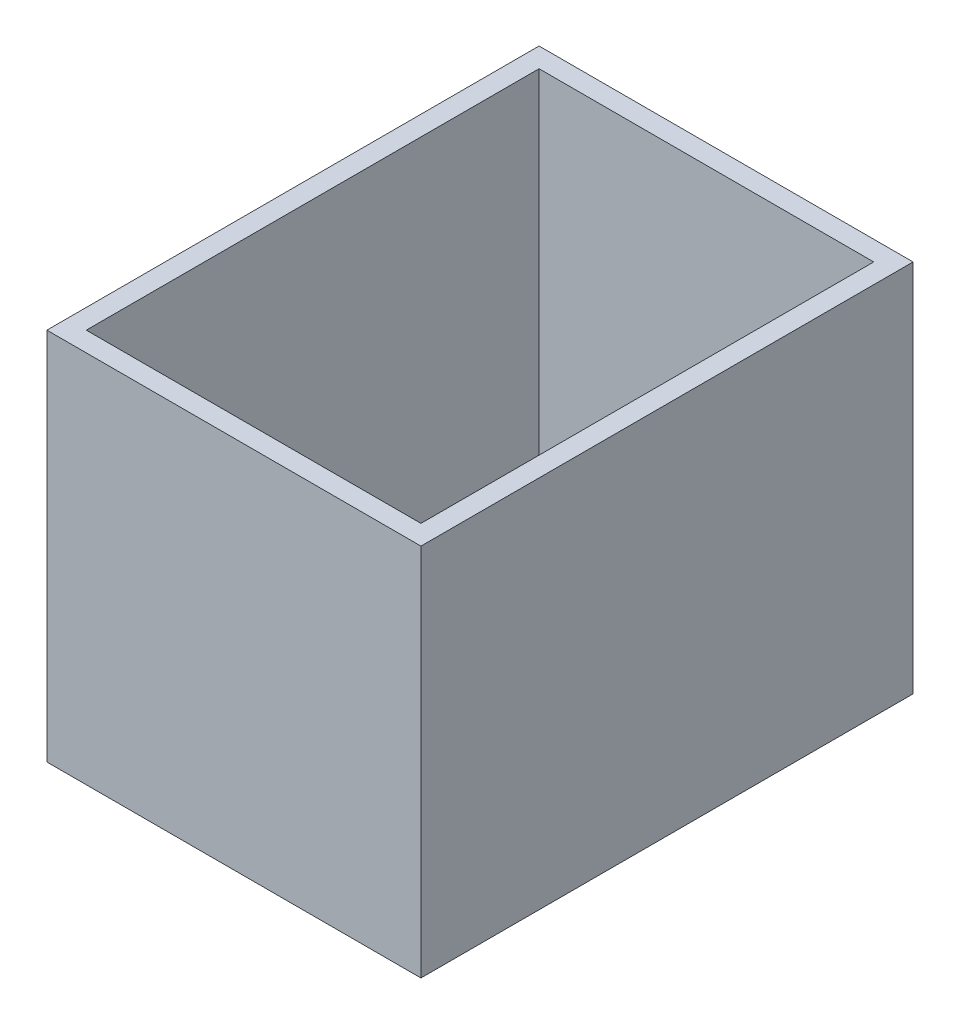
ISO-10303-21;
HEADER;
FILE_DESCRIPTION(('STEP AP214'),'2;1');
FILE_NAME('part.step','',(''),(''),'','','');
FILE_SCHEMA(('AUTOMOTIVE_DESIGN { 1 0 10303 214 1 1 1 1 }'));
ENDSEC;
DATA;
#1=APPLICATION_CONTEXT('core data for automotive mechanical design processes');
#2=APPLICATION_PROTOCOL_DEFINITION('international standard','automotive_design',2000,#1);
#3=PRODUCT_CONTEXT('',#1,'mechanical');
#4=PRODUCT('Part','Part','',(#3));
#5=PRODUCT_RELATED_PRODUCT_CATEGORY('part','',(#4));
#6=PRODUCT_DEFINITION_FORMATION('','',#4);
#7=PRODUCT_DEFINITION_CONTEXT('part definition',#1,'design');
#8=PRODUCT_DEFINITION('design','',#6,#7);
#9=PRODUCT_DEFINITION_SHAPE('','',#8);
#10=(LENGTH_UNIT() NAMED_UNIT(*) SI_UNIT(.MILLI.,.METRE.));
#11=(NAMED_UNIT(*) PLANE_ANGLE_UNIT() SI_UNIT($,.RADIAN.));
#12=(NAMED_UNIT(*) SI_UNIT($,.STERADIAN.) SOLID_ANGLE_UNIT());
#13=UNCERTAINTY_MEASURE_WITH_UNIT(LENGTH_MEASURE(1.E-05),#10,'distance_accuracy_value','');
#14=(GEOMETRIC_REPRESENTATION_CONTEXT(3) GLOBAL_UNCERTAINTY_ASSIGNED_CONTEXT((#13)) GLOBAL_UNIT_ASSIGNED_CONTEXT((#10,
#11,#12)) REPRESENTATION_CONTEXT('',''));
#15=CARTESIAN_POINT('',(0.,0.,0.));
#16=DIRECTION('',(0.,0.,1.));
#17=DIRECTION('',(1.,0.,0.));
#18=AXIS2_PLACEMENT_3D('',#15,#16,#17);
#19=CARTESIAN_POINT('',(11.8949453755539,32.2575191530075,127.));
#20=DIRECTION('',(1.,0.,0.));
#21=DIRECTION('',(0.,0.,-1.));
#22=AXIS2_PLACEMENT_3D('',#19,#20,#21);
#23=PLANE('',#22);
#24=DIRECTION('',(0.,-1.,0.));
#25=VECTOR('',#24,1.);
#26=CARTESIAN_POINT('',(11.8949453755539,32.2575191530075,0.));
#27=LINE('',#26,#25);
#28=CARTESIAN_POINT('',(11.8949453755539,32.2575191530075,0.));
#29=VERTEX_POINT('',#28);
#30=CARTESIAN_POINT('',(11.8949453755539,-64.2624808469925,0.));
#31=VERTEX_POINT('',#30);
#32=EDGE_CURVE('E165',#29,#31,#27,.T.);
#33=ORIENTED_EDGE('',*,*,#32,.T.);
#34=DIRECTION('',(0.,0.,-1.));
#35=VECTOR('',#34,1.);
#36=CARTESIAN_POINT('',(11.8949453755539,-64.2624808469925,127.));
#37=LINE('',#36,#35);
#38=CARTESIAN_POINT('',(11.8949453755539,-64.2624808469925,127.));
#39=VERTEX_POINT('',#38);
#40=EDGE_CURVE('E11',#39,#31,#37,.T.);
#41=ORIENTED_EDGE('',*,*,#40,.F.);
#42=DIRECTION('',(0.,-1.,0.));
#43=VECTOR('',#42,1.);
#44=CARTESIAN_POINT('',(11.8949453755539,32.2575191530075,127.));
#45=LINE('',#44,#43);
#46=CARTESIAN_POINT('',(11.8949453755539,32.2575191530075,127.));
#47=VERTEX_POINT('',#46);
#48=EDGE_CURVE('E171',#47,#39,#45,.T.);
#49=ORIENTED_EDGE('',*,*,#48,.F.);
#50=DIRECTION('',(0.,0.,-1.));
#51=VECTOR('',#50,1.);
#52=CARTESIAN_POINT('',(11.8949453755539,32.2575191530075,127.));
#53=LINE('',#52,#51);
#54=EDGE_CURVE('E181',#47,#29,#53,.T.);
#55=ORIENTED_EDGE('',*,*,#54,.T.);
#56=EDGE_LOOP('',(#33,#41,#49,#55));
#57=FACE_BOUND('',#56,.T.);
#58=ADVANCED_FACE('F45',(#57),#23,.F.);
#59=CARTESIAN_POINT('',(11.8949453755539,-64.2624808469925,127.));
#60=DIRECTION('',(0.,1.,0.));
#61=DIRECTION('',(-1.,0.,0.));
#62=AXIS2_PLACEMENT_3D('',#59,#60,#61);
#63=PLANE('',#62);
#64=DIRECTION('',(1.,0.,0.));
#65=VECTOR('',#64,1.);
#66=CARTESIAN_POINT('',(11.8949453755539,-64.2624808469925,0.));
#67=LINE('',#66,#65);
#68=CARTESIAN_POINT('',(108.414945375554,-64.2624808469925,0.));
#69=VERTEX_POINT('',#68);
#70=EDGE_CURVE('E185',#31,#69,#67,.T.);
#71=ORIENTED_EDGE('',*,*,#70,.T.);
#72=DIRECTION('',(0.,0.,-1.));
#73=VECTOR('',#72,1.);
#74=CARTESIAN_POINT('',(108.414945375554,-64.2624808469925,127.));
#75=LINE('',#74,#73);
#76=CARTESIAN_POINT('',(108.414945375554,-64.2624808469925,127.));
#77=VERTEX_POINT('',#76);
#78=EDGE_CURVE('E53',#77,#69,#75,.T.);
#79=ORIENTED_EDGE('',*,*,#78,.F.);
#80=DIRECTION('',(1.,0.,0.));
#81=VECTOR('',#80,1.);
#82=CARTESIAN_POINT('',(11.8949453755539,-64.2624808469925,127.));
#83=LINE('',#82,#81);
#84=EDGE_CURVE('E97',#39,#77,#83,.T.);
#85=ORIENTED_EDGE('',*,*,#84,.F.);
#86=ORIENTED_EDGE('',*,*,#40,.T.);
#87=EDGE_LOOP('',(#71,#79,#85,#86));
#88=FACE_BOUND('',#87,.T.);
#89=ADVANCED_FACE('F221',(#88),#63,.F.);
#90=CARTESIAN_POINT('',(108.414945375554,32.2575191530075,127.));
#91=DIRECTION('',(-1.,0.,0.));
#92=DIRECTION('',(0.,0.,1.));
#93=AXIS2_PLACEMENT_3D('',#90,#91,#92);
#94=PLANE('',#93);
#95=DIRECTION('',(0.,1.,0.));
#96=VECTOR('',#95,1.);
#97=CARTESIAN_POINT('',(108.414945375554,32.2575191530075,0.));
#98=LINE('',#97,#96);
#99=CARTESIAN_POINT('',(108.414945375554,32.2575191530075,0.));
#100=VERTEX_POINT('',#99);
#101=EDGE_CURVE('E188',#69,#100,#98,.T.);
#102=ORIENTED_EDGE('',*,*,#101,.T.);
#103=DIRECTION('',(0.,0.,-1.));
#104=VECTOR('',#103,1.);
#105=CARTESIAN_POINT('',(108.414945375554,32.2575191530075,127.));
#106=LINE('',#105,#104);
#107=CARTESIAN_POINT('',(108.414945375554,32.2575191530075,127.));
#108=VERTEX_POINT('',#107);
#109=EDGE_CURVE('E195',#108,#100,#106,.T.);
#110=ORIENTED_EDGE('',*,*,#109,.F.);
#111=DIRECTION('',(0.,1.,0.));
#112=VECTOR('',#111,1.);
#113=CARTESIAN_POINT('',(108.414945375554,32.2575191530075,127.));
#114=LINE('',#113,#112);
#115=EDGE_CURVE('E176',#77,#108,#114,.T.);
#116=ORIENTED_EDGE('',*,*,#115,.F.);
#117=ORIENTED_EDGE('',*,*,#78,.T.);
#118=EDGE_LOOP('',(#102,#110,#116,#117));
#119=FACE_BOUND('',#118,.T.);
#120=ADVANCED_FACE('F203',(#119),#94,.F.);
#121=CARTESIAN_POINT('',(11.8949453755539,32.2575191530075,127.));
#122=DIRECTION('',(0.,-1.,0.));
#123=DIRECTION('',(0.,0.,-1.));
#124=AXIS2_PLACEMENT_3D('',#121,#122,#123);
#125=PLANE('',#124);
#126=DIRECTION('',(1.,0.,0.));
#127=VECTOR('',#126,1.);
#128=CARTESIAN_POINT('',(16.9749453755539,32.2575191530075,121.92));
#129=LINE('',#128,#127);
#130=CARTESIAN_POINT('',(16.9749453755539,32.2575191530075,121.92));
#131=VERTEX_POINT('',#130);
#132=CARTESIAN_POINT('',(103.334945375554,32.2575191530075,121.92));
#133=VERTEX_POINT('',#132);
#134=EDGE_CURVE('E156',#131,#133,#129,.T.);
#135=ORIENTED_EDGE('',*,*,#134,.F.);
#136=DIRECTION('',(0.,0.,1.));
#137=VECTOR('',#136,1.);
#138=CARTESIAN_POINT('',(16.9749453755539,32.2575191530075,121.92));
#139=LINE('',#138,#137);
#140=CARTESIAN_POINT('',(16.9749453755539,32.2575191530075,5.08));
#141=VERTEX_POINT('',#140);
#142=EDGE_CURVE('E60',#141,#131,#139,.T.);
#143=ORIENTED_EDGE('',*,*,#142,.F.);
#144=DIRECTION('',(-1.,0.,0.));
#145=VECTOR('',#144,1.);
#146=CARTESIAN_POINT('',(16.9749453755539,32.2575191530075,5.08));
#147=LINE('',#146,#145);
#148=CARTESIAN_POINT('',(103.334945375554,32.2575191530075,5.08));
#149=VERTEX_POINT('',#148);
#150=EDGE_CURVE('E142',#149,#141,#147,.T.);
#151=ORIENTED_EDGE('',*,*,#150,.F.);
#152=DIRECTION('',(0.,0.,-1.));
#153=VECTOR('',#152,1.);
#154=CARTESIAN_POINT('',(103.334945375554,32.2575191530075,121.92));
#155=LINE('',#154,#153);
#156=EDGE_CURVE('E147',#133,#149,#155,.T.);
#157=ORIENTED_EDGE('',*,*,#156,.F.);
#158=EDGE_LOOP('',(#135,#143,#151,#157));
#159=FACE_BOUND('',#158,.T.);
#160=DIRECTION('',(-1.,0.,0.));
#161=VECTOR('',#160,1.);
#162=CARTESIAN_POINT('',(11.8949453755539,32.2575191530075,0.));
#163=LINE('',#162,#161);
#164=EDGE_CURVE('E90',#100,#29,#163,.T.);
#165=ORIENTED_EDGE('',*,*,#164,.T.);
#166=ORIENTED_EDGE('',*,*,#54,.F.);
#167=DIRECTION('',(-1.,0.,0.));
#168=VECTOR('',#167,1.);
#169=CARTESIAN_POINT('',(11.8949453755539,32.2575191530075,127.));
#170=LINE('',#169,#168);
#171=EDGE_CURVE('E69',#108,#47,#170,.T.);
#172=ORIENTED_EDGE('',*,*,#171,.F.);
#173=ORIENTED_EDGE('',*,*,#109,.T.);
#174=EDGE_LOOP('',(#165,#166,#172,#173));
#175=FACE_BOUND('',#174,.T.);
#176=ADVANCED_FACE('F211',(#159,#175),#125,.F.);
#177=CARTESIAN_POINT('',(0.,0.,127.));
#178=DIRECTION('',(0.,0.,1.));
#179=DIRECTION('',(1.,0.,0.));
#180=AXIS2_PLACEMENT_3D('',#177,#178,#179);
#181=PLANE('',#180);
#182=ORIENTED_EDGE('',*,*,#48,.T.);
#183=ORIENTED_EDGE('',*,*,#84,.T.);
#184=ORIENTED_EDGE('',*,*,#115,.T.);
#185=ORIENTED_EDGE('',*,*,#171,.T.);
#186=EDGE_LOOP('',(#182,#183,#184,#185));
#187=FACE_BOUND('',#186,.T.);
#188=ADVANCED_FACE('F213',(#187),#181,.T.);
#189=CARTESIAN_POINT('',(0.,0.,0.));
#190=DIRECTION('',(0.,0.,1.));
#191=DIRECTION('',(1.,0.,0.));
#192=AXIS2_PLACEMENT_3D('',#189,#190,#191);
#193=PLANE('',#192);
#194=ORIENTED_EDGE('',*,*,#32,.F.);
#195=ORIENTED_EDGE('',*,*,#164,.F.);
#196=ORIENTED_EDGE('',*,*,#101,.F.);
#197=ORIENTED_EDGE('',*,*,#70,.F.);
#198=EDGE_LOOP('',(#194,#195,#196,#197));
#199=FACE_BOUND('',#198,.T.);
#200=ADVANCED_FACE('F207',(#199),#193,.F.);
#201=CARTESIAN_POINT('',(16.9749453755539,-59.1824808469925,121.92));
#202=DIRECTION('',(-1.,0.,0.));
#203=DIRECTION('',(0.,0.,1.));
#204=AXIS2_PLACEMENT_3D('',#201,#202,#203);
#205=PLANE('',#204);
#206=ORIENTED_EDGE('',*,*,#142,.T.);
#207=DIRECTION('',(0.,1.,0.));
#208=VECTOR('',#207,1.);
#209=CARTESIAN_POINT('',(16.9749453755539,-59.1824808469925,121.92));
#210=LINE('',#209,#208);
#211=CARTESIAN_POINT('',(16.9749453755539,-59.1824808469925,121.92));
#212=VERTEX_POINT('',#211);
#213=EDGE_CURVE('E117',#212,#131,#210,.T.);
#214=ORIENTED_EDGE('',*,*,#213,.F.);
#215=DIRECTION('',(0.,0.,1.));
#216=VECTOR('',#215,1.);
#217=CARTESIAN_POINT('',(16.9749453755539,-59.1824808469925,121.92));
#218=LINE('',#217,#216);
#219=CARTESIAN_POINT('',(16.9749453755539,-59.1824808469925,5.08));
#220=VERTEX_POINT('',#219);
#221=EDGE_CURVE('E121',#220,#212,#218,.T.);
#222=ORIENTED_EDGE('',*,*,#221,.F.);
#223=DIRECTION('',(0.,1.,0.));
#224=VECTOR('',#223,1.);
#225=CARTESIAN_POINT('',(16.9749453755539,-59.1824808469925,5.08));
#226=LINE('',#225,#224);
#227=EDGE_CURVE('E162',#220,#141,#226,.T.);
#228=ORIENTED_EDGE('',*,*,#227,.T.);
#229=EDGE_LOOP('',(#206,#214,#222,#228));
#230=FACE_BOUND('',#229,.T.);
#231=ADVANCED_FACE('F119',(#230),#205,.F.);
#232=CARTESIAN_POINT('',(16.9749453755539,-59.1824808469925,5.08));
#233=DIRECTION('',(0.,0.,-1.));
#234=DIRECTION('',(-1.,0.,0.));
#235=AXIS2_PLACEMENT_3D('',#232,#233,#234);
#236=PLANE('',#235);
#237=ORIENTED_EDGE('',*,*,#150,.T.);
#238=ORIENTED_EDGE('',*,*,#227,.F.);
#239=DIRECTION('',(-1.,0.,0.));
#240=VECTOR('',#239,1.);
#241=CARTESIAN_POINT('',(16.9749453755539,-59.1824808469925,5.08));
#242=LINE('',#241,#240);
#243=CARTESIAN_POINT('',(103.334945375554,-59.1824808469925,5.08));
#244=VERTEX_POINT('',#243);
#245=EDGE_CURVE('E128',#244,#220,#242,.T.);
#246=ORIENTED_EDGE('',*,*,#245,.F.);
#247=DIRECTION('',(0.,1.,0.));
#248=VECTOR('',#247,1.);
#249=CARTESIAN_POINT('',(103.334945375554,-59.1824808469925,5.08));
#250=LINE('',#249,#248);
#251=EDGE_CURVE('E166',#244,#149,#250,.T.);
#252=ORIENTED_EDGE('',*,*,#251,.T.);
#253=EDGE_LOOP('',(#237,#238,#246,#252));
#254=FACE_BOUND('',#253,.T.);
#255=ADVANCED_FACE('F264',(#254),#236,.F.);
#256=CARTESIAN_POINT('',(103.334945375554,-59.1824808469925,121.92));
#257=DIRECTION('',(1.,0.,0.));
#258=DIRECTION('',(0.,0.,-1.));
#259=AXIS2_PLACEMENT_3D('',#256,#257,#258);
#260=PLANE('',#259);
#261=ORIENTED_EDGE('',*,*,#156,.T.);
#262=ORIENTED_EDGE('',*,*,#251,.F.);
#263=DIRECTION('',(0.,0.,-1.));
#264=VECTOR('',#263,1.);
#265=CARTESIAN_POINT('',(103.334945375554,-59.1824808469925,121.92));
#266=LINE('',#265,#264);
#267=CARTESIAN_POINT('',(103.334945375554,-59.1824808469925,121.92));
#268=VERTEX_POINT('',#267);
#269=EDGE_CURVE('E137',#268,#244,#266,.T.);
#270=ORIENTED_EDGE('',*,*,#269,.F.);
#271=DIRECTION('',(0.,1.,0.));
#272=VECTOR('',#271,1.);
#273=CARTESIAN_POINT('',(103.334945375554,-59.1824808469925,121.92));
#274=LINE('',#273,#272);
#275=EDGE_CURVE('E127',#268,#133,#274,.T.);
#276=ORIENTED_EDGE('',*,*,#275,.T.);
#277=EDGE_LOOP('',(#261,#262,#270,#276));
#278=FACE_BOUND('',#277,.T.);
#279=ADVANCED_FACE('F274',(#278),#260,.F.);
#280=CARTESIAN_POINT('',(16.9749453755539,-59.1824808469925,121.92));
#281=DIRECTION('',(0.,0.,1.));
#282=DIRECTION('',(1.,0.,0.));
#283=AXIS2_PLACEMENT_3D('',#280,#281,#282);
#284=PLANE('',#283);
#285=ORIENTED_EDGE('',*,*,#134,.T.);
#286=ORIENTED_EDGE('',*,*,#275,.F.);
#287=DIRECTION('',(1.,0.,0.));
#288=VECTOR('',#287,1.);
#289=CARTESIAN_POINT('',(16.9749453755539,-59.1824808469925,121.92));
#290=LINE('',#289,#288);
#291=EDGE_CURVE('E131',#212,#268,#290,.T.);
#292=ORIENTED_EDGE('',*,*,#291,.F.);
#293=ORIENTED_EDGE('',*,*,#213,.T.);
#294=EDGE_LOOP('',(#285,#286,#292,#293));
#295=FACE_BOUND('',#294,.T.);
#296=ADVANCED_FACE('F132',(#295),#284,.F.);
#297=CARTESIAN_POINT('',(0.,-59.1824808469925,0.));
#298=DIRECTION('',(0.,-1.,0.));
#299=DIRECTION('',(0.,0.,-1.));
#300=AXIS2_PLACEMENT_3D('',#297,#298,#299);
#301=PLANE('',#300);
#302=ORIENTED_EDGE('',*,*,#221,.T.);
#303=ORIENTED_EDGE('',*,*,#291,.T.);
#304=ORIENTED_EDGE('',*,*,#269,.T.);
#305=ORIENTED_EDGE('',*,*,#245,.T.);
#306=EDGE_LOOP('',(#302,#303,#304,#305));
#307=FACE_BOUND('',#306,.T.);
#308=ADVANCED_FACE('F139',(#307),#301,.F.);
#309=CLOSED_SHELL('',(#58,#89,#120,#176,#188,#200,#231,#255,#279,#296,#308));
#310=MANIFOLD_SOLID_BREP('B2',#309);
#311=ADVANCED_BREP_SHAPE_REPRESENTATION('',(#18,#310),#14);
#312=SHAPE_DEFINITION_REPRESENTATION(#9,#311);
ENDSEC;
END-ISO-10303-21;
